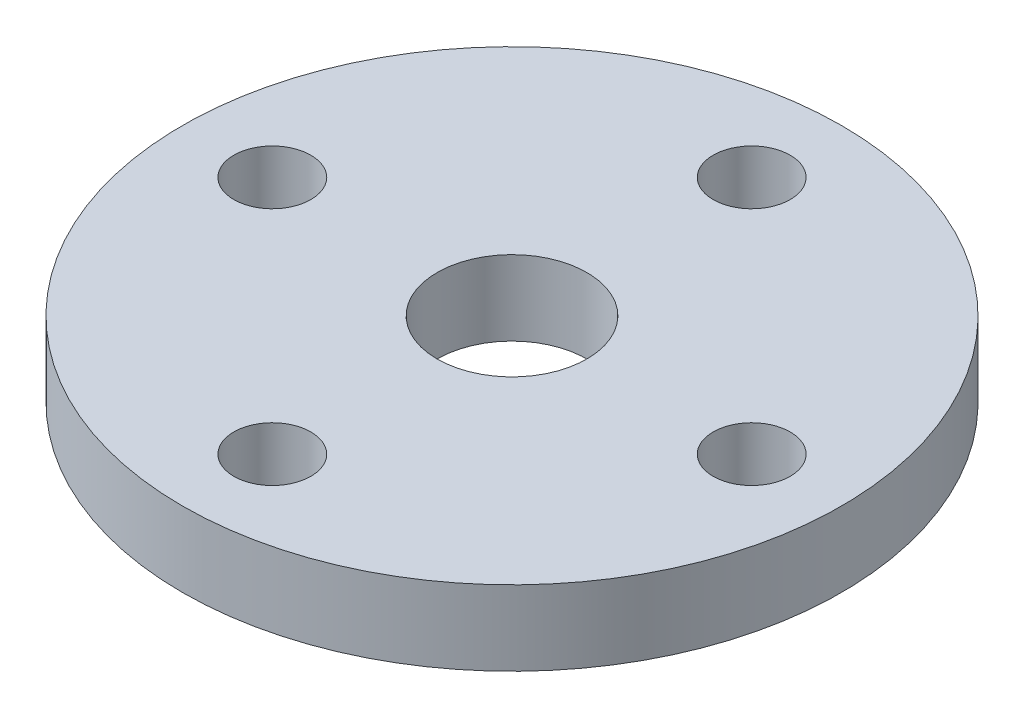
ISO-10303-21;
HEADER;
FILE_DESCRIPTION(('STEP AP214'),'2;1');
FILE_NAME('part.step','',(''),(''),'','','');
FILE_SCHEMA(('AUTOMOTIVE_DESIGN { 1 0 10303 214 1 1 1 1 }'));
ENDSEC;
DATA;
#1=APPLICATION_CONTEXT('core data for automotive mechanical design processes');
#2=APPLICATION_PROTOCOL_DEFINITION('international standard','automotive_design',2000,#1);
#3=PRODUCT_CONTEXT('',#1,'mechanical');
#4=PRODUCT('Part','Part','',(#3));
#5=PRODUCT_RELATED_PRODUCT_CATEGORY('part','',(#4));
#6=PRODUCT_DEFINITION_FORMATION('','',#4);
#7=PRODUCT_DEFINITION_CONTEXT('part definition',#1,'design');
#8=PRODUCT_DEFINITION('design','',#6,#7);
#9=PRODUCT_DEFINITION_SHAPE('','',#8);
#10=(LENGTH_UNIT() NAMED_UNIT(*) SI_UNIT(.MILLI.,.METRE.));
#11=(NAMED_UNIT(*) PLANE_ANGLE_UNIT() SI_UNIT($,.RADIAN.));
#12=(NAMED_UNIT(*) SI_UNIT($,.STERADIAN.) SOLID_ANGLE_UNIT());
#13=UNCERTAINTY_MEASURE_WITH_UNIT(LENGTH_MEASURE(1.E-05),#10,'distance_accuracy_value','');
#14=(GEOMETRIC_REPRESENTATION_CONTEXT(3) GLOBAL_UNCERTAINTY_ASSIGNED_CONTEXT((#13)) GLOBAL_UNIT_ASSIGNED_CONTEXT((#10,
#11,#12)) REPRESENTATION_CONTEXT('',''));
#15=CARTESIAN_POINT('',(0.,0.,0.));
#16=DIRECTION('',(0.,0.,1.));
#17=DIRECTION('',(1.,0.,0.));
#18=AXIS2_PLACEMENT_3D('',#15,#16,#17);
#19=CARTESIAN_POINT('',(0.,3.175,0.));
#20=DIRECTION('',(0.,-1.,0.));
#21=DIRECTION('',(0.,0.,-1.));
#22=AXIS2_PLACEMENT_3D('',#19,#20,#21);
#23=CYLINDRICAL_SURFACE('',#22,13.97);
#24=CARTESIAN_POINT('',(0.,3.175,0.));
#25=DIRECTION('',(0.,1.,0.));
#26=DIRECTION('',(0.,0.,1.));
#27=AXIS2_PLACEMENT_3D('',#24,#25,#26);
#28=CIRCLE('',#27,13.97);
#29=CARTESIAN_POINT('',(0.,3.175,13.97));
#30=VERTEX_POINT('',#29);
#31=EDGE_CURVE('E10',#30,#30,#28,.T.);
#32=ORIENTED_EDGE('',*,*,#31,.F.);
#33=EDGE_LOOP('',(#32));
#34=FACE_BOUND('',#33,.T.);
#35=CARTESIAN_POINT('',(0.,0.,0.));
#36=DIRECTION('',(0.,1.,0.));
#37=DIRECTION('',(0.,0.,1.));
#38=AXIS2_PLACEMENT_3D('',#35,#36,#37);
#39=CIRCLE('',#38,13.97);
#40=CARTESIAN_POINT('',(0.,0.,13.97));
#41=VERTEX_POINT('',#40);
#42=EDGE_CURVE('E34',#41,#41,#39,.T.);
#43=ORIENTED_EDGE('',*,*,#42,.T.);
#44=EDGE_LOOP('',(#43));
#45=FACE_BOUND('',#44,.T.);
#46=ADVANCED_FACE('F31',(#34,#45),#23,.T.);
#47=CARTESIAN_POINT('',(0.,3.175,0.));
#48=DIRECTION('',(0.,1.,0.));
#49=DIRECTION('',(0.,0.,1.));
#50=AXIS2_PLACEMENT_3D('',#47,#48,#49);
#51=PLANE('',#50);
#52=CARTESIAN_POINT('',(10.16,3.175,-1.06420351207939E-13));
#53=DIRECTION('',(0.,1.,0.));
#54=DIRECTION('',(0.,0.,1.));
#55=AXIS2_PLACEMENT_3D('',#52,#53,#54);
#56=CIRCLE('',#55,1.63194999999999);
#57=CARTESIAN_POINT('',(10.16,3.175,1.63194999999988));
#58=VERTEX_POINT('',#57);
#59=EDGE_CURVE('E69',#58,#58,#56,.T.);
#60=ORIENTED_EDGE('',*,*,#59,.F.);
#61=EDGE_LOOP('',(#60));
#62=FACE_BOUND('',#61,.T.);
#63=CARTESIAN_POINT('',(0.,3.175,10.16));
#64=DIRECTION('',(0.,1.,0.));
#65=DIRECTION('',(0.,0.,1.));
#66=AXIS2_PLACEMENT_3D('',#63,#64,#65);
#67=CIRCLE('',#66,1.63194999999999);
#68=CARTESIAN_POINT('',(0.,3.175,11.79195));
#69=VERTEX_POINT('',#68);
#70=EDGE_CURVE('E63',#69,#69,#67,.T.);
#71=ORIENTED_EDGE('',*,*,#70,.F.);
#72=EDGE_LOOP('',(#71));
#73=FACE_BOUND('',#72,.T.);
#74=CARTESIAN_POINT('',(-10.16,3.175,0.));
#75=DIRECTION('',(0.,1.,0.));
#76=DIRECTION('',(0.,0.,1.));
#77=AXIS2_PLACEMENT_3D('',#74,#75,#76);
#78=CIRCLE('',#77,1.63194999999999);
#79=CARTESIAN_POINT('',(-10.16,3.175,1.63195000000003));
#80=VERTEX_POINT('',#79);
#81=EDGE_CURVE('E57',#80,#80,#78,.T.);
#82=ORIENTED_EDGE('',*,*,#81,.F.);
#83=EDGE_LOOP('',(#82));
#84=FACE_BOUND('',#83,.T.);
#85=CARTESIAN_POINT('',(0.,3.175,-10.16));
#86=DIRECTION('',(0.,1.,0.));
#87=DIRECTION('',(0.,0.,1.));
#88=AXIS2_PLACEMENT_3D('',#85,#86,#87);
#89=CIRCLE('',#88,1.63194999999999);
#90=CARTESIAN_POINT('',(0.,3.175,-8.52805000000001));
#91=VERTEX_POINT('',#90);
#92=EDGE_CURVE('E51',#91,#91,#89,.T.);
#93=ORIENTED_EDGE('',*,*,#92,.F.);
#94=EDGE_LOOP('',(#93));
#95=FACE_BOUND('',#94,.T.);
#96=CARTESIAN_POINT('',(0.,3.175,0.));
#97=DIRECTION('',(0.,1.,0.));
#98=DIRECTION('',(0.,0.,1.));
#99=AXIS2_PLACEMENT_3D('',#96,#97,#98);
#100=CIRCLE('',#99,3.175);
#101=CARTESIAN_POINT('',(0.,3.175,3.175));
#102=VERTEX_POINT('',#101);
#103=EDGE_CURVE('E43',#102,#102,#100,.T.);
#104=ORIENTED_EDGE('',*,*,#103,.F.);
#105=EDGE_LOOP('',(#104));
#106=FACE_BOUND('',#105,.T.);
#107=ORIENTED_EDGE('',*,*,#31,.T.);
#108=EDGE_LOOP('',(#107));
#109=FACE_BOUND('',#108,.T.);
#110=ADVANCED_FACE('F76',(#62,#73,#84,#95,#106,#109),#51,.T.);
#111=CARTESIAN_POINT('',(0.,0.,0.));
#112=DIRECTION('',(0.,1.,0.));
#113=DIRECTION('',(0.,0.,1.));
#114=AXIS2_PLACEMENT_3D('',#111,#112,#113);
#115=PLANE('',#114);
#116=CARTESIAN_POINT('',(10.16,0.,-1.06420351207939E-13));
#117=DIRECTION('',(0.,1.,0.));
#118=DIRECTION('',(0.,0.,1.));
#119=AXIS2_PLACEMENT_3D('',#116,#117,#118);
#120=CIRCLE('',#119,1.63194999999999);
#121=CARTESIAN_POINT('',(10.16,0.,1.63194999999988));
#122=VERTEX_POINT('',#121);
#123=EDGE_CURVE('E66',#122,#122,#120,.T.);
#124=ORIENTED_EDGE('',*,*,#123,.T.);
#125=EDGE_LOOP('',(#124));
#126=FACE_BOUND('',#125,.T.);
#127=CARTESIAN_POINT('',(0.,0.,10.16));
#128=DIRECTION('',(0.,1.,0.));
#129=DIRECTION('',(0.,0.,1.));
#130=AXIS2_PLACEMENT_3D('',#127,#128,#129);
#131=CIRCLE('',#130,1.63194999999999);
#132=CARTESIAN_POINT('',(0.,0.,11.79195));
#133=VERTEX_POINT('',#132);
#134=EDGE_CURVE('E60',#133,#133,#131,.T.);
#135=ORIENTED_EDGE('',*,*,#134,.T.);
#136=EDGE_LOOP('',(#135));
#137=FACE_BOUND('',#136,.T.);
#138=CARTESIAN_POINT('',(-10.16,0.,0.));
#139=DIRECTION('',(0.,1.,0.));
#140=DIRECTION('',(0.,0.,1.));
#141=AXIS2_PLACEMENT_3D('',#138,#139,#140);
#142=CIRCLE('',#141,1.63194999999999);
#143=CARTESIAN_POINT('',(-10.16,0.,1.63195000000002));
#144=VERTEX_POINT('',#143);
#145=EDGE_CURVE('E54',#144,#144,#142,.T.);
#146=ORIENTED_EDGE('',*,*,#145,.T.);
#147=EDGE_LOOP('',(#146));
#148=FACE_BOUND('',#147,.T.);
#149=CARTESIAN_POINT('',(0.,0.,-10.16));
#150=DIRECTION('',(0.,1.,0.));
#151=DIRECTION('',(0.,0.,1.));
#152=AXIS2_PLACEMENT_3D('',#149,#150,#151);
#153=CIRCLE('',#152,1.63194999999999);
#154=CARTESIAN_POINT('',(0.,0.,-8.52805000000001));
#155=VERTEX_POINT('',#154);
#156=EDGE_CURVE('E46',#155,#155,#153,.T.);
#157=ORIENTED_EDGE('',*,*,#156,.T.);
#158=EDGE_LOOP('',(#157));
#159=FACE_BOUND('',#158,.T.);
#160=CARTESIAN_POINT('',(0.,0.,0.));
#161=DIRECTION('',(0.,1.,0.));
#162=DIRECTION('',(0.,0.,1.));
#163=AXIS2_PLACEMENT_3D('',#160,#161,#162);
#164=CIRCLE('',#163,3.175);
#165=CARTESIAN_POINT('',(0.,0.,3.175));
#166=VERTEX_POINT('',#165);
#167=EDGE_CURVE('E41',#166,#166,#164,.T.);
#168=ORIENTED_EDGE('',*,*,#167,.T.);
#169=EDGE_LOOP('',(#168));
#170=FACE_BOUND('',#169,.T.);
#171=ORIENTED_EDGE('',*,*,#42,.F.);
#172=EDGE_LOOP('',(#171));
#173=FACE_BOUND('',#172,.T.);
#174=ADVANCED_FACE('F79',(#126,#137,#148,#159,#170,#173),#115,.F.);
#175=CARTESIAN_POINT('',(0.,0.,0.));
#176=DIRECTION('',(0.,1.,0.));
#177=DIRECTION('',(0.,0.,1.));
#178=AXIS2_PLACEMENT_3D('',#175,#176,#177);
#179=CYLINDRICAL_SURFACE('',#178,3.175);
#180=ORIENTED_EDGE('',*,*,#167,.F.);
#181=EDGE_LOOP('',(#180));
#182=FACE_BOUND('',#181,.T.);
#183=ORIENTED_EDGE('',*,*,#103,.T.);
#184=EDGE_LOOP('',(#183));
#185=FACE_BOUND('',#184,.T.);
#186=ADVANCED_FACE('F89',(#182,#185),#179,.F.);
#187=CARTESIAN_POINT('',(0.,3.175,-10.16));
#188=DIRECTION('',(0.,1.,0.));
#189=DIRECTION('',(0.,0.,1.));
#190=AXIS2_PLACEMENT_3D('',#187,#188,#189);
#191=CYLINDRICAL_SURFACE('',#190,1.63194999999999);
#192=ORIENTED_EDGE('',*,*,#92,.T.);
#193=EDGE_LOOP('',(#192));
#194=FACE_BOUND('',#193,.T.);
#195=ORIENTED_EDGE('',*,*,#156,.F.);
#196=EDGE_LOOP('',(#195));
#197=FACE_BOUND('',#196,.T.);
#198=ADVANCED_FACE('F91',(#194,#197),#191,.F.);
#199=CARTESIAN_POINT('',(-10.16,3.175,0.));
#200=DIRECTION('',(0.,1.,0.));
#201=DIRECTION('',(0.,0.,1.));
#202=AXIS2_PLACEMENT_3D('',#199,#200,#201);
#203=CYLINDRICAL_SURFACE('',#202,1.63194999999999);
#204=ORIENTED_EDGE('',*,*,#81,.T.);
#205=EDGE_LOOP('',(#204));
#206=FACE_BOUND('',#205,.T.);
#207=ORIENTED_EDGE('',*,*,#145,.F.);
#208=EDGE_LOOP('',(#207));
#209=FACE_BOUND('',#208,.T.);
#210=ADVANCED_FACE('F98',(#206,#209),#203,.F.);
#211=CARTESIAN_POINT('',(0.,3.175,10.16));
#212=DIRECTION('',(0.,1.,0.));
#213=DIRECTION('',(0.,0.,1.));
#214=AXIS2_PLACEMENT_3D('',#211,#212,#213);
#215=CYLINDRICAL_SURFACE('',#214,1.63194999999999);
#216=ORIENTED_EDGE('',*,*,#70,.T.);
#217=EDGE_LOOP('',(#216));
#218=FACE_BOUND('',#217,.T.);
#219=ORIENTED_EDGE('',*,*,#134,.F.);
#220=EDGE_LOOP('',(#219));
#221=FACE_BOUND('',#220,.T.);
#222=ADVANCED_FACE('F129',(#218,#221),#215,.F.);
#223=CARTESIAN_POINT('',(10.16,3.175,-1.06420351207939E-13));
#224=DIRECTION('',(0.,1.,0.));
#225=DIRECTION('',(0.,0.,1.));
#226=AXIS2_PLACEMENT_3D('',#223,#224,#225);
#227=CYLINDRICAL_SURFACE('',#226,1.63194999999999);
#228=ORIENTED_EDGE('',*,*,#59,.T.);
#229=EDGE_LOOP('',(#228));
#230=FACE_BOUND('',#229,.T.);
#231=ORIENTED_EDGE('',*,*,#123,.F.);
#232=EDGE_LOOP('',(#231));
#233=FACE_BOUND('',#232,.T.);
#234=ADVANCED_FACE('F73',(#230,#233),#227,.F.);
#235=CLOSED_SHELL('',(#46,#110,#174,#186,#198,#210,#222,#234));
#236=MANIFOLD_SOLID_BREP('B2',#235);
#237=ADVANCED_BREP_SHAPE_REPRESENTATION('',(#18,#236),#14);
#238=SHAPE_DEFINITION_REPRESENTATION(#9,#237);
ENDSEC;
END-ISO-10303-21;
